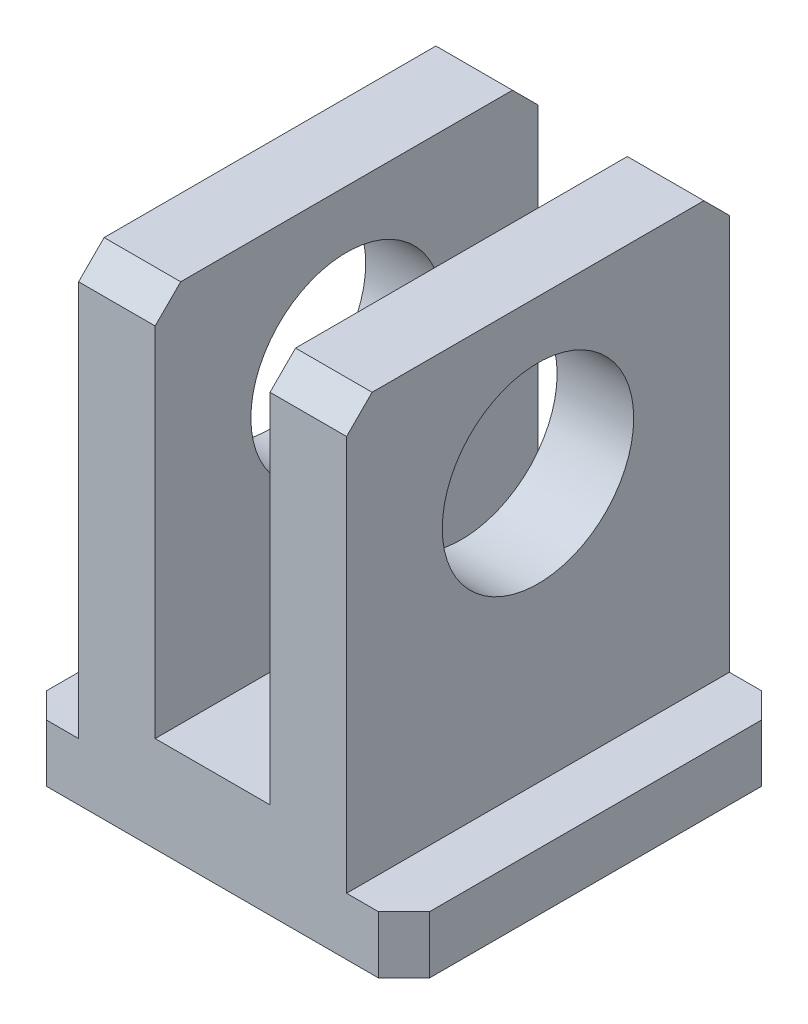
ISO-10303-21;
HEADER;
FILE_DESCRIPTION(('STEP AP214'),'2;1');
FILE_NAME('part.step','',(''),(''),'','','');
FILE_SCHEMA(('AUTOMOTIVE_DESIGN { 1 0 10303 214 1 1 1 1 }'));
ENDSEC;
DATA;
#1=APPLICATION_CONTEXT('core data for automotive mechanical design processes');
#2=APPLICATION_PROTOCOL_DEFINITION('international standard','automotive_design',2000,#1);
#3=PRODUCT_CONTEXT('',#1,'mechanical');
#4=PRODUCT('Part','Part','',(#3));
#5=PRODUCT_RELATED_PRODUCT_CATEGORY('part','',(#4));
#6=PRODUCT_DEFINITION_FORMATION('','',#4);
#7=PRODUCT_DEFINITION_CONTEXT('part definition',#1,'design');
#8=PRODUCT_DEFINITION('design','',#6,#7);
#9=PRODUCT_DEFINITION_SHAPE('','',#8);
#10=(LENGTH_UNIT() NAMED_UNIT(*) SI_UNIT(.MILLI.,.METRE.));
#11=(NAMED_UNIT(*) PLANE_ANGLE_UNIT() SI_UNIT($,.RADIAN.));
#12=(NAMED_UNIT(*) SI_UNIT($,.STERADIAN.) SOLID_ANGLE_UNIT());
#13=UNCERTAINTY_MEASURE_WITH_UNIT(LENGTH_MEASURE(1.E-05),#10,'distance_accuracy_value','');
#14=(GEOMETRIC_REPRESENTATION_CONTEXT(3) GLOBAL_UNCERTAINTY_ASSIGNED_CONTEXT((#13)) GLOBAL_UNIT_ASSIGNED_CONTEXT((#10,
#11,#12)) REPRESENTATION_CONTEXT('',''));
#15=CARTESIAN_POINT('',(0.,0.,0.));
#16=DIRECTION('',(0.,0.,1.));
#17=DIRECTION('',(1.,0.,0.));
#18=AXIS2_PLACEMENT_3D('',#15,#16,#17);
#19=CARTESIAN_POINT('',(15.,37.5,-30.));
#20=DIRECTION('',(0.,-1.,0.));
#21=DIRECTION('',(0.,0.,-1.));
#22=AXIS2_PLACEMENT_3D('',#19,#20,#21);
#23=PLANE('',#22);
#24=DIRECTION('',(-1.,0.,0.));
#25=VECTOR('',#24,1.);
#26=CARTESIAN_POINT('',(15.,37.5,-28.));
#27=LINE('',#26,#25);
#28=CARTESIAN_POINT('',(-4.5,37.5,-28.));
#29=VERTEX_POINT('',#28);
#30=CARTESIAN_POINT('',(-10.5,37.5,-28.));
#31=VERTEX_POINT('',#30);
#32=EDGE_CURVE('E207',#29,#31,#27,.T.);
#33=ORIENTED_EDGE('',*,*,#32,.T.);
#34=DIRECTION('',(0.,0.,1.));
#35=VECTOR('',#34,1.);
#36=CARTESIAN_POINT('',(-10.5,37.5,-30.001));
#37=LINE('',#36,#35);
#38=CARTESIAN_POINT('',(-10.5,37.5,-2.00000000000002));
#39=VERTEX_POINT('',#38);
#40=EDGE_CURVE('E176',#31,#39,#37,.T.);
#41=ORIENTED_EDGE('',*,*,#40,.T.);
#42=DIRECTION('',(1.,0.,0.));
#43=VECTOR('',#42,1.);
#44=CARTESIAN_POINT('',(15.,37.5,-2.00000000000002));
#45=LINE('',#44,#43);
#46=CARTESIAN_POINT('',(-4.5,37.5,-2.00000000000002));
#47=VERTEX_POINT('',#46);
#48=EDGE_CURVE('E310',#39,#47,#45,.T.);
#49=ORIENTED_EDGE('',*,*,#48,.T.);
#50=DIRECTION('',(0.,0.,1.));
#51=VECTOR('',#50,1.);
#52=CARTESIAN_POINT('',(-4.5,37.5,-30.001));
#53=LINE('',#52,#51);
#54=EDGE_CURVE('E285',#29,#47,#53,.T.);
#55=ORIENTED_EDGE('',*,*,#54,.F.);
#56=EDGE_LOOP('',(#33,#41,#49,#55));
#57=FACE_BOUND('',#56,.T.);
#58=ADVANCED_FACE('F33',(#57),#23,.F.);
#59=CARTESIAN_POINT('',(15.,37.5,-28.));
#60=DIRECTION('',(0.,-0.707106781186546,0.707106781186549));
#61=DIRECTION('',(-1.,0.,0.));
#62=AXIS2_PLACEMENT_3D('',#59,#60,#61);
#63=PLANE('',#62);
#64=DIRECTION('',(0.,-0.707106781186549,-0.707106781186546));
#65=VECTOR('',#64,1.);
#66=CARTESIAN_POINT('',(-10.5,36.4995,-29.0005));
#67=LINE('',#66,#65);
#68=CARTESIAN_POINT('',(-10.5,35.5,-30.));
#69=VERTEX_POINT('',#68);
#70=EDGE_CURVE('E169',#69,#31,#67,.F.);
#71=ORIENTED_EDGE('',*,*,#70,.T.);
#72=ORIENTED_EDGE('',*,*,#32,.F.);
#73=DIRECTION('',(0.,0.707106781186549,0.707106781186546));
#74=VECTOR('',#73,1.);
#75=CARTESIAN_POINT('',(-4.5,36.4995,-29.0005));
#76=LINE('',#75,#74);
#77=CARTESIAN_POINT('',(-4.5,35.5,-30.));
#78=VERTEX_POINT('',#77);
#79=EDGE_CURVE('E197',#29,#78,#76,.F.);
#80=ORIENTED_EDGE('',*,*,#79,.T.);
#81=DIRECTION('',(1.,0.,0.));
#82=VECTOR('',#81,1.);
#83=CARTESIAN_POINT('',(15.,35.5,-30.));
#84=LINE('',#83,#82);
#85=EDGE_CURVE('E190',#69,#78,#84,.T.);
#86=ORIENTED_EDGE('',*,*,#85,.F.);
#87=EDGE_LOOP('',(#71,#72,#80,#86));
#88=FACE_BOUND('',#87,.T.);
#89=ADVANCED_FACE('F196',(#88),#63,.F.);
#90=CARTESIAN_POINT('',(15.,35.5,0.));
#91=DIRECTION('',(0.,-0.707106781186549,-0.707106781186546));
#92=DIRECTION('',(-1.,0.,0.));
#93=AXIS2_PLACEMENT_3D('',#90,#91,#92);
#94=PLANE('',#93);
#95=DIRECTION('',(0.,0.707106781186546,-0.707106781186549));
#96=VECTOR('',#95,1.);
#97=CARTESIAN_POINT('',(-10.5,51.5005,-16.0005000000001));
#98=LINE('',#97,#96);
#99=CARTESIAN_POINT('',(-10.5,35.5,0.));
#100=VERTEX_POINT('',#99);
#101=EDGE_CURVE('E182',#39,#100,#98,.F.);
#102=ORIENTED_EDGE('',*,*,#101,.T.);
#103=DIRECTION('',(-1.,0.,0.));
#104=VECTOR('',#103,1.);
#105=CARTESIAN_POINT('',(15.,35.5,0.));
#106=LINE('',#105,#104);
#107=CARTESIAN_POINT('',(-4.5,35.5,0.));
#108=VERTEX_POINT('',#107);
#109=EDGE_CURVE('E198',#108,#100,#106,.T.);
#110=ORIENTED_EDGE('',*,*,#109,.F.);
#111=DIRECTION('',(0.,-0.707106781186546,0.707106781186549));
#112=VECTOR('',#111,1.);
#113=CARTESIAN_POINT('',(-4.5,51.5005,-16.0005000000001));
#114=LINE('',#113,#112);
#115=EDGE_CURVE('E266',#108,#47,#114,.F.);
#116=ORIENTED_EDGE('',*,*,#115,.T.);
#117=ORIENTED_EDGE('',*,*,#48,.F.);
#118=EDGE_LOOP('',(#102,#110,#116,#117));
#119=FACE_BOUND('',#118,.T.);
#120=ADVANCED_FACE('F392',(#119),#94,.F.);
#121=CARTESIAN_POINT('',(15.,37.5,0.));
#122=DIRECTION('',(0.,0.,-1.));
#123=DIRECTION('',(-1.,0.,0.));
#124=AXIS2_PLACEMENT_3D('',#121,#122,#123);
#125=PLANE('',#124);
#126=DIRECTION('',(1.,0.,0.));
#127=VECTOR('',#126,1.);
#128=CARTESIAN_POINT('',(-15.,4.5,0.));
#129=LINE('',#128,#127);
#130=CARTESIAN_POINT('',(-13.,4.5,0.));
#131=VERTEX_POINT('',#130);
#132=CARTESIAN_POINT('',(-10.5,4.5,0.));
#133=VERTEX_POINT('',#132);
#134=EDGE_CURVE('E193',#131,#133,#129,.T.);
#135=ORIENTED_EDGE('',*,*,#134,.F.);
#136=DIRECTION('',(0.,-1.,0.));
#137=VECTOR('',#136,1.);
#138=CARTESIAN_POINT('',(-13.,37.5,0.));
#139=LINE('',#138,#137);
#140=CARTESIAN_POINT('',(-13.,0.,0.));
#141=VERTEX_POINT('',#140);
#142=EDGE_CURVE('E232',#131,#141,#139,.T.);
#143=ORIENTED_EDGE('',*,*,#142,.T.);
#144=DIRECTION('',(-1.,0.,0.));
#145=VECTOR('',#144,1.);
#146=CARTESIAN_POINT('',(15.,0.,0.));
#147=LINE('',#146,#145);
#148=CARTESIAN_POINT('',(13.,0.,0.));
#149=VERTEX_POINT('',#148);
#150=EDGE_CURVE('E306',#149,#141,#147,.T.);
#151=ORIENTED_EDGE('',*,*,#150,.F.);
#152=DIRECTION('',(0.,1.,0.));
#153=VECTOR('',#152,1.);
#154=CARTESIAN_POINT('',(13.,4.5,0.));
#155=LINE('',#154,#153);
#156=CARTESIAN_POINT('',(13.,4.5,0.));
#157=VERTEX_POINT('',#156);
#158=EDGE_CURVE('E230',#149,#157,#155,.T.);
#159=ORIENTED_EDGE('',*,*,#158,.T.);
#160=DIRECTION('',(1.,0.,0.));
#161=VECTOR('',#160,1.);
#162=CARTESIAN_POINT('',(10.5,4.5,0.));
#163=LINE('',#162,#161);
#164=CARTESIAN_POINT('',(10.5,4.5,0.));
#165=VERTEX_POINT('',#164);
#166=EDGE_CURVE('E258',#165,#157,#163,.T.);
#167=ORIENTED_EDGE('',*,*,#166,.F.);
#168=DIRECTION('',(0.,-1.,0.));
#169=VECTOR('',#168,1.);
#170=CARTESIAN_POINT('',(10.5,37.5,0.));
#171=LINE('',#170,#169);
#172=CARTESIAN_POINT('',(10.5,35.5,0.));
#173=VERTEX_POINT('',#172);
#174=EDGE_CURVE('E344',#173,#165,#171,.T.);
#175=ORIENTED_EDGE('',*,*,#174,.F.);
#176=CARTESIAN_POINT('',(4.5,35.5,0.));
#177=VERTEX_POINT('',#176);
#178=EDGE_CURVE('E202',#173,#177,#106,.T.);
#179=ORIENTED_EDGE('',*,*,#178,.T.);
#180=DIRECTION('',(0.,1.,0.));
#181=VECTOR('',#180,1.);
#182=CARTESIAN_POINT('',(4.5,37.5,0.));
#183=LINE('',#182,#181);
#184=CARTESIAN_POINT('',(4.5,7.5,0.));
#185=VERTEX_POINT('',#184);
#186=EDGE_CURVE('E282',#185,#177,#183,.T.);
#187=ORIENTED_EDGE('',*,*,#186,.F.);
#188=DIRECTION('',(1.,0.,0.));
#189=VECTOR('',#188,1.);
#190=CARTESIAN_POINT('',(-4.5,7.5,0.));
#191=LINE('',#190,#189);
#192=CARTESIAN_POINT('',(-4.5,7.5,0.));
#193=VERTEX_POINT('',#192);
#194=EDGE_CURVE('E279',#193,#185,#191,.T.);
#195=ORIENTED_EDGE('',*,*,#194,.F.);
#196=DIRECTION('',(0.,-1.,0.));
#197=VECTOR('',#196,1.);
#198=CARTESIAN_POINT('',(-4.5,37.5,0.));
#199=LINE('',#198,#197);
#200=EDGE_CURVE('E276',#108,#193,#199,.T.);
#201=ORIENTED_EDGE('',*,*,#200,.F.);
#202=ORIENTED_EDGE('',*,*,#109,.T.);
#203=DIRECTION('',(0.,1.,0.));
#204=VECTOR('',#203,1.);
#205=CARTESIAN_POINT('',(-10.5,37.5,0.));
#206=LINE('',#205,#204);
#207=EDGE_CURVE('E355',#133,#100,#206,.T.);
#208=ORIENTED_EDGE('',*,*,#207,.F.);
#209=EDGE_LOOP('',(#135,#143,#151,#159,#167,#175,#179,#187,#195,#201,#202,#208));
#210=FACE_BOUND('',#209,.T.);
#211=ADVANCED_FACE('F341',(#210),#125,.F.);
#212=CARTESIAN_POINT('',(15.,0.,0.));
#213=DIRECTION('',(0.,1.,0.));
#214=DIRECTION('',(0.,0.,1.));
#215=AXIS2_PLACEMENT_3D('',#212,#213,#214);
#216=PLANE('',#215);
#217=DIRECTION('',(0.,0.,-1.));
#218=VECTOR('',#217,1.);
#219=CARTESIAN_POINT('',(-15.,0.,0.));
#220=LINE('',#219,#218);
#221=CARTESIAN_POINT('',(-15.,0.,-2.00000000000001));
#222=VERTEX_POINT('',#221);
#223=CARTESIAN_POINT('',(-15.,0.,-28.));
#224=VERTEX_POINT('',#223);
#225=EDGE_CURVE('E302',#222,#224,#220,.T.);
#226=ORIENTED_EDGE('',*,*,#225,.T.);
#227=DIRECTION('',(-0.707106781186546,0.,0.707106781186549));
#228=VECTOR('',#227,1.);
#229=CARTESIAN_POINT('',(-13.,0.,-30.));
#230=LINE('',#229,#228);
#231=CARTESIAN_POINT('',(-13.,0.,-30.));
#232=VERTEX_POINT('',#231);
#233=EDGE_CURVE('E228',#224,#232,#230,.F.);
#234=ORIENTED_EDGE('',*,*,#233,.T.);
#235=DIRECTION('',(-1.,0.,0.));
#236=VECTOR('',#235,1.);
#237=CARTESIAN_POINT('',(15.,0.,-30.));
#238=LINE('',#237,#236);
#239=CARTESIAN_POINT('',(13.,0.,-30.));
#240=VERTEX_POINT('',#239);
#241=EDGE_CURVE('E301',#240,#232,#238,.T.);
#242=ORIENTED_EDGE('',*,*,#241,.F.);
#243=DIRECTION('',(0.707106781186549,0.,0.707106781186546));
#244=VECTOR('',#243,1.);
#245=CARTESIAN_POINT('',(15.,0.,-28.));
#246=LINE('',#245,#244);
#247=CARTESIAN_POINT('',(15.,0.,-28.));
#248=VERTEX_POINT('',#247);
#249=EDGE_CURVE('E224',#240,#248,#246,.T.);
#250=ORIENTED_EDGE('',*,*,#249,.T.);
#251=DIRECTION('',(0.,0.,-1.));
#252=VECTOR('',#251,1.);
#253=CARTESIAN_POINT('',(15.,0.,0.));
#254=LINE('',#253,#252);
#255=CARTESIAN_POINT('',(15.,0.,-2.));
#256=VERTEX_POINT('',#255);
#257=EDGE_CURVE('E245',#256,#248,#254,.T.);
#258=ORIENTED_EDGE('',*,*,#257,.F.);
#259=DIRECTION('',(-0.707106781186549,0.,0.707106781186546));
#260=VECTOR('',#259,1.);
#261=CARTESIAN_POINT('',(15.,0.,-2.));
#262=LINE('',#261,#260);
#263=EDGE_CURVE('E222',#256,#149,#262,.T.);
#264=ORIENTED_EDGE('',*,*,#263,.T.);
#265=ORIENTED_EDGE('',*,*,#150,.T.);
#266=DIRECTION('',(0.707106781186546,0.,0.707106781186549));
#267=VECTOR('',#266,1.);
#268=CARTESIAN_POINT('',(-13.,0.,0.));
#269=LINE('',#268,#267);
#270=EDGE_CURVE('E226',#141,#222,#269,.F.);
#271=ORIENTED_EDGE('',*,*,#270,.T.);
#272=EDGE_LOOP('',(#226,#234,#242,#250,#258,#264,#265,#271));
#273=FACE_BOUND('',#272,.T.);
#274=ADVANCED_FACE('F408',(#273),#216,.F.);
#275=CARTESIAN_POINT('',(15.,0.,-30.));
#276=DIRECTION('',(0.,0.,1.));
#277=DIRECTION('',(1.,0.,0.));
#278=AXIS2_PLACEMENT_3D('',#275,#276,#277);
#279=PLANE('',#278);
#280=ORIENTED_EDGE('',*,*,#241,.T.);
#281=DIRECTION('',(0.,1.,0.));
#282=VECTOR('',#281,1.);
#283=CARTESIAN_POINT('',(-13.,0.,-30.));
#284=LINE('',#283,#282);
#285=CARTESIAN_POINT('',(-13.,4.5,-30.));
#286=VERTEX_POINT('',#285);
#287=EDGE_CURVE('E212',#232,#286,#284,.T.);
#288=ORIENTED_EDGE('',*,*,#287,.T.);
#289=DIRECTION('',(-1.,0.,0.));
#290=VECTOR('',#289,1.);
#291=CARTESIAN_POINT('',(-15.,4.5,-30.));
#292=LINE('',#291,#290);
#293=CARTESIAN_POINT('',(-10.5,4.5,-30.));
#294=VERTEX_POINT('',#293);
#295=EDGE_CURVE('E181',#294,#286,#292,.T.);
#296=ORIENTED_EDGE('',*,*,#295,.F.);
#297=DIRECTION('',(0.,-1.,0.));
#298=VECTOR('',#297,1.);
#299=CARTESIAN_POINT('',(-10.5,37.5,-30.));
#300=LINE('',#299,#298);
#301=EDGE_CURVE('E173',#69,#294,#300,.T.);
#302=ORIENTED_EDGE('',*,*,#301,.F.);
#303=ORIENTED_EDGE('',*,*,#85,.T.);
#304=DIRECTION('',(0.,1.,0.));
#305=VECTOR('',#304,1.);
#306=CARTESIAN_POINT('',(-4.5,37.5,-30.));
#307=LINE('',#306,#305);
#308=CARTESIAN_POINT('',(-4.5,7.5,-30.));
#309=VERTEX_POINT('',#308);
#310=EDGE_CURVE('E273',#309,#78,#307,.T.);
#311=ORIENTED_EDGE('',*,*,#310,.F.);
#312=DIRECTION('',(-1.,0.,0.));
#313=VECTOR('',#312,1.);
#314=CARTESIAN_POINT('',(-4.5,7.5,-30.));
#315=LINE('',#314,#313);
#316=CARTESIAN_POINT('',(4.5,7.5,-30.));
#317=VERTEX_POINT('',#316);
#318=EDGE_CURVE('E287',#317,#309,#315,.T.);
#319=ORIENTED_EDGE('',*,*,#318,.F.);
#320=DIRECTION('',(0.,-1.,0.));
#321=VECTOR('',#320,1.);
#322=CARTESIAN_POINT('',(4.5,37.5,-30.));
#323=LINE('',#322,#321);
#324=CARTESIAN_POINT('',(4.5,35.5,-30.));
#325=VERTEX_POINT('',#324);
#326=EDGE_CURVE('E270',#325,#317,#323,.T.);
#327=ORIENTED_EDGE('',*,*,#326,.F.);
#328=CARTESIAN_POINT('',(10.5,35.5,-30.));
#329=VERTEX_POINT('',#328);
#330=EDGE_CURVE('E199',#325,#329,#84,.T.);
#331=ORIENTED_EDGE('',*,*,#330,.T.);
#332=DIRECTION('',(0.,1.,0.));
#333=VECTOR('',#332,1.);
#334=CARTESIAN_POINT('',(10.5,37.5,-30.));
#335=LINE('',#334,#333);
#336=CARTESIAN_POINT('',(10.5,4.5,-30.));
#337=VERTEX_POINT('',#336);
#338=EDGE_CURVE('E253',#337,#329,#335,.T.);
#339=ORIENTED_EDGE('',*,*,#338,.F.);
#340=DIRECTION('',(-1.,0.,0.));
#341=VECTOR('',#340,1.);
#342=CARTESIAN_POINT('',(10.5,4.5,-30.));
#343=LINE('',#342,#341);
#344=CARTESIAN_POINT('',(13.,4.5,-30.));
#345=VERTEX_POINT('',#344);
#346=EDGE_CURVE('E347',#345,#337,#343,.T.);
#347=ORIENTED_EDGE('',*,*,#346,.F.);
#348=DIRECTION('',(0.,-1.,0.));
#349=VECTOR('',#348,1.);
#350=CARTESIAN_POINT('',(13.,0.,-30.));
#351=LINE('',#350,#349);
#352=EDGE_CURVE('E210',#345,#240,#351,.T.);
#353=ORIENTED_EDGE('',*,*,#352,.T.);
#354=EDGE_LOOP('',(#280,#288,#296,#302,#303,#311,#319,#327,#331,#339,#347,#353));
#355=FACE_BOUND('',#354,.T.);
#356=ADVANCED_FACE('F188',(#355),#279,.F.);
#357=CARTESIAN_POINT('',(4.5,37.5,-2.00000000000002));
#358=VERTEX_POINT('',#357);
#359=CARTESIAN_POINT('',(10.5,37.5,-2.00000000000002));
#360=VERTEX_POINT('',#359);
#361=EDGE_CURVE('E308',#358,#360,#45,.T.);
#362=ORIENTED_EDGE('',*,*,#361,.T.);
#363=DIRECTION('',(0.,0.,1.));
#364=VECTOR('',#363,1.);
#365=CARTESIAN_POINT('',(10.5,37.5,-30.001));
#366=LINE('',#365,#364);
#367=CARTESIAN_POINT('',(10.5,37.5,-28.));
#368=VERTEX_POINT('',#367);
#369=EDGE_CURVE('E255',#368,#360,#366,.T.);
#370=ORIENTED_EDGE('',*,*,#369,.F.);
#371=CARTESIAN_POINT('',(4.5,37.5,-28.));
#372=VERTEX_POINT('',#371);
#373=EDGE_CURVE('E205',#368,#372,#27,.T.);
#374=ORIENTED_EDGE('',*,*,#373,.T.);
#375=DIRECTION('',(0.,0.,1.));
#376=VECTOR('',#375,1.);
#377=CARTESIAN_POINT('',(4.5,37.5,-30.001));
#378=LINE('',#377,#376);
#379=EDGE_CURVE('E288',#372,#358,#378,.T.);
#380=ORIENTED_EDGE('',*,*,#379,.T.);
#381=EDGE_LOOP('',(#362,#370,#374,#380));
#382=FACE_BOUND('',#381,.T.);
#383=ADVANCED_FACE('F320',(#382),#23,.F.);
#384=CARTESIAN_POINT('',(15.,0.,0.));
#385=DIRECTION('',(1.,0.,0.));
#386=DIRECTION('',(0.,0.,-1.));
#387=AXIS2_PLACEMENT_3D('',#384,#385,#386);
#388=PLANE('',#387);
#389=ORIENTED_EDGE('',*,*,#257,.T.);
#390=DIRECTION('',(0.,1.,0.));
#391=VECTOR('',#390,1.);
#392=CARTESIAN_POINT('',(15.,4.5,-28.));
#393=LINE('',#392,#391);
#394=CARTESIAN_POINT('',(15.,4.5,-28.));
#395=VERTEX_POINT('',#394);
#396=EDGE_CURVE('E238',#248,#395,#393,.T.);
#397=ORIENTED_EDGE('',*,*,#396,.T.);
#398=DIRECTION('',(0.,0.,1.));
#399=VECTOR('',#398,1.);
#400=CARTESIAN_POINT('',(15.,4.5,-30.001));
#401=LINE('',#400,#399);
#402=CARTESIAN_POINT('',(15.,4.5,-2.));
#403=VERTEX_POINT('',#402);
#404=EDGE_CURVE('E242',#395,#403,#401,.T.);
#405=ORIENTED_EDGE('',*,*,#404,.T.);
#406=DIRECTION('',(0.,-1.,0.));
#407=VECTOR('',#406,1.);
#408=CARTESIAN_POINT('',(15.,0.,-2.));
#409=LINE('',#408,#407);
#410=EDGE_CURVE('E235',#403,#256,#409,.T.);
#411=ORIENTED_EDGE('',*,*,#410,.T.);
#412=EDGE_LOOP('',(#389,#397,#405,#411));
#413=FACE_BOUND('',#412,.T.);
#414=ADVANCED_FACE('F241',(#413),#388,.T.);
#415=CARTESIAN_POINT('',(-15.,0.,0.));
#416=DIRECTION('',(1.,0.,0.));
#417=DIRECTION('',(0.,0.,-1.));
#418=AXIS2_PLACEMENT_3D('',#415,#416,#417);
#419=PLANE('',#418);
#420=DIRECTION('',(0.,0.,1.));
#421=VECTOR('',#420,1.);
#422=CARTESIAN_POINT('',(-15.,4.5,-30.001));
#423=LINE('',#422,#421);
#424=CARTESIAN_POINT('',(-15.,4.5,-28.));
#425=VERTEX_POINT('',#424);
#426=CARTESIAN_POINT('',(-15.,4.5,-2.00000000000001));
#427=VERTEX_POINT('',#426);
#428=EDGE_CURVE('E351',#425,#427,#423,.T.);
#429=ORIENTED_EDGE('',*,*,#428,.F.);
#430=DIRECTION('',(0.,-1.,0.));
#431=VECTOR('',#430,1.);
#432=CARTESIAN_POINT('',(-15.,0.,-28.));
#433=LINE('',#432,#431);
#434=EDGE_CURVE('E220',#425,#224,#433,.T.);
#435=ORIENTED_EDGE('',*,*,#434,.T.);
#436=ORIENTED_EDGE('',*,*,#225,.F.);
#437=DIRECTION('',(0.,1.,0.));
#438=VECTOR('',#437,1.);
#439=CARTESIAN_POINT('',(-15.,0.,-2.00000000000001));
#440=LINE('',#439,#438);
#441=EDGE_CURVE('E218',#222,#427,#440,.T.);
#442=ORIENTED_EDGE('',*,*,#441,.T.);
#443=EDGE_LOOP('',(#429,#435,#436,#442));
#444=FACE_BOUND('',#443,.T.);
#445=ADVANCED_FACE('F406',(#444),#419,.F.);
#446=DIRECTION('',(0.,0.707106781186549,0.707106781186546));
#447=VECTOR('',#446,1.);
#448=CARTESIAN_POINT('',(10.5,36.4995,-29.0005));
#449=LINE('',#448,#447);
#450=EDGE_CURVE('E249',#368,#329,#449,.F.);
#451=ORIENTED_EDGE('',*,*,#450,.T.);
#452=ORIENTED_EDGE('',*,*,#330,.F.);
#453=DIRECTION('',(0.,-0.707106781186549,-0.707106781186546));
#454=VECTOR('',#453,1.);
#455=CARTESIAN_POINT('',(4.5,36.4995,-29.0005));
#456=LINE('',#455,#454);
#457=EDGE_CURVE('E296',#325,#372,#456,.F.);
#458=ORIENTED_EDGE('',*,*,#457,.T.);
#459=ORIENTED_EDGE('',*,*,#373,.F.);
#460=EDGE_LOOP('',(#451,#452,#458,#459));
#461=FACE_BOUND('',#460,.T.);
#462=ADVANCED_FACE('F322',(#461),#63,.F.);
#463=DIRECTION('',(0.,-0.707106781186546,0.707106781186549));
#464=VECTOR('',#463,1.);
#465=CARTESIAN_POINT('',(10.5,51.5005,-16.0005000000001));
#466=LINE('',#465,#464);
#467=EDGE_CURVE('E299',#173,#360,#466,.F.);
#468=ORIENTED_EDGE('',*,*,#467,.T.);
#469=ORIENTED_EDGE('',*,*,#361,.F.);
#470=DIRECTION('',(0.,0.707106781186546,-0.707106781186549));
#471=VECTOR('',#470,1.);
#472=CARTESIAN_POINT('',(4.5,51.5005,-16.0005000000001));
#473=LINE('',#472,#471);
#474=EDGE_CURVE('E263',#358,#177,#473,.F.);
#475=ORIENTED_EDGE('',*,*,#474,.T.);
#476=ORIENTED_EDGE('',*,*,#178,.F.);
#477=EDGE_LOOP('',(#468,#469,#475,#476));
#478=FACE_BOUND('',#477,.T.);
#479=ADVANCED_FACE('F338',(#478),#94,.F.);
#480=CARTESIAN_POINT('',(-4.5,37.5,-30.001));
#481=DIRECTION('',(-1.,0.,0.));
#482=DIRECTION('',(0.,0.,1.));
#483=AXIS2_PLACEMENT_3D('',#480,#481,#482);
#484=PLANE('',#483);
#485=CARTESIAN_POINT('',(-4.5,25.5,-15.));
#486=DIRECTION('',(-1.,0.,0.));
#487=DIRECTION('',(0.,0.,1.));
#488=AXIS2_PLACEMENT_3D('',#485,#486,#487);
#489=CIRCLE('',#488,7.5);
#490=CARTESIAN_POINT('',(-4.5,25.5,-7.5));
#491=VERTEX_POINT('',#490);
#492=EDGE_CURVE('E267',#491,#491,#489,.T.);
#493=ORIENTED_EDGE('',*,*,#492,.T.);
#494=EDGE_LOOP('',(#493));
#495=FACE_BOUND('',#494,.T.);
#496=ORIENTED_EDGE('',*,*,#310,.T.);
#497=ORIENTED_EDGE('',*,*,#79,.F.);
#498=ORIENTED_EDGE('',*,*,#54,.T.);
#499=ORIENTED_EDGE('',*,*,#115,.F.);
#500=ORIENTED_EDGE('',*,*,#200,.T.);
#501=DIRECTION('',(0.,0.,1.));
#502=VECTOR('',#501,1.);
#503=CARTESIAN_POINT('',(-4.5,7.5,-30.001));
#504=LINE('',#503,#502);
#505=EDGE_CURVE('E284',#309,#193,#504,.T.);
#506=ORIENTED_EDGE('',*,*,#505,.F.);
#507=EDGE_LOOP('',(#496,#497,#498,#499,#500,#506));
#508=FACE_BOUND('',#507,.T.);
#509=ADVANCED_FACE('F384',(#495,#508),#484,.F.);
#510=CARTESIAN_POINT('',(4.5,37.5,-30.001));
#511=DIRECTION('',(1.,0.,0.));
#512=DIRECTION('',(0.,0.,-1.));
#513=AXIS2_PLACEMENT_3D('',#510,#511,#512);
#514=PLANE('',#513);
#515=CARTESIAN_POINT('',(4.5,25.5,-15.));
#516=DIRECTION('',(1.,0.,0.));
#517=DIRECTION('',(0.,0.,-1.));
#518=AXIS2_PLACEMENT_3D('',#515,#516,#517);
#519=CIRCLE('',#518,7.5);
#520=CARTESIAN_POINT('',(4.5,25.5,-22.5));
#521=VERTEX_POINT('',#520);
#522=EDGE_CURVE('E365',#521,#521,#519,.T.);
#523=ORIENTED_EDGE('',*,*,#522,.T.);
#524=EDGE_LOOP('',(#523));
#525=FACE_BOUND('',#524,.T.);
#526=ORIENTED_EDGE('',*,*,#326,.T.);
#527=DIRECTION('',(0.,0.,1.));
#528=VECTOR('',#527,1.);
#529=CARTESIAN_POINT('',(4.5,7.5,-30.001));
#530=LINE('',#529,#528);
#531=EDGE_CURVE('E291',#317,#185,#530,.T.);
#532=ORIENTED_EDGE('',*,*,#531,.T.);
#533=ORIENTED_EDGE('',*,*,#186,.T.);
#534=ORIENTED_EDGE('',*,*,#474,.F.);
#535=ORIENTED_EDGE('',*,*,#379,.F.);
#536=ORIENTED_EDGE('',*,*,#457,.F.);
#537=EDGE_LOOP('',(#526,#532,#533,#534,#535,#536));
#538=FACE_BOUND('',#537,.T.);
#539=ADVANCED_FACE('F326',(#525,#538),#514,.F.);
#540=CARTESIAN_POINT('',(-4.5,7.5,-30.001));
#541=DIRECTION('',(0.,-1.,0.));
#542=DIRECTION('',(0.,0.,-1.));
#543=AXIS2_PLACEMENT_3D('',#540,#541,#542);
#544=PLANE('',#543);
#545=ORIENTED_EDGE('',*,*,#318,.T.);
#546=ORIENTED_EDGE('',*,*,#505,.T.);
#547=ORIENTED_EDGE('',*,*,#194,.T.);
#548=ORIENTED_EDGE('',*,*,#531,.F.);
#549=EDGE_LOOP('',(#545,#546,#547,#548));
#550=FACE_BOUND('',#549,.T.);
#551=ADVANCED_FACE('F330',(#550),#544,.F.);
#552=CARTESIAN_POINT('',(10.5,4.5,-30.001));
#553=DIRECTION('',(0.,-1.,0.));
#554=DIRECTION('',(0.,0.,-1.));
#555=AXIS2_PLACEMENT_3D('',#552,#553,#554);
#556=PLANE('',#555);
#557=ORIENTED_EDGE('',*,*,#404,.F.);
#558=DIRECTION('',(-0.707106781186549,0.,-0.707106781186546));
#559=VECTOR('',#558,1.);
#560=CARTESIAN_POINT('',(15.,4.5,-28.));
#561=LINE('',#560,#559);
#562=EDGE_CURVE('E11',#395,#345,#561,.T.);
#563=ORIENTED_EDGE('',*,*,#562,.T.);
#564=ORIENTED_EDGE('',*,*,#346,.T.);
#565=DIRECTION('',(0.,0.,1.));
#566=VECTOR('',#565,1.);
#567=CARTESIAN_POINT('',(10.5,4.5,-30.001));
#568=LINE('',#567,#566);
#569=EDGE_CURVE('E250',#337,#165,#568,.T.);
#570=ORIENTED_EDGE('',*,*,#569,.T.);
#571=ORIENTED_EDGE('',*,*,#166,.T.);
#572=DIRECTION('',(0.707106781186549,0.,-0.707106781186546));
#573=VECTOR('',#572,1.);
#574=CARTESIAN_POINT('',(15.,4.5,-2.));
#575=LINE('',#574,#573);
#576=EDGE_CURVE('E41',#157,#403,#575,.T.);
#577=ORIENTED_EDGE('',*,*,#576,.T.);
#578=EDGE_LOOP('',(#557,#563,#564,#570,#571,#577));
#579=FACE_BOUND('',#578,.T.);
#580=ADVANCED_FACE('F247',(#579),#556,.F.);
#581=CARTESIAN_POINT('',(10.5,37.5,-30.001));
#582=DIRECTION('',(-1.,0.,0.));
#583=DIRECTION('',(0.,0.,1.));
#584=AXIS2_PLACEMENT_3D('',#581,#582,#583);
#585=PLANE('',#584);
#586=CARTESIAN_POINT('',(10.5,25.5,-15.));
#587=DIRECTION('',(1.,0.,0.));
#588=DIRECTION('',(0.,0.,-1.));
#589=AXIS2_PLACEMENT_3D('',#586,#587,#588);
#590=CIRCLE('',#589,7.5);
#591=CARTESIAN_POINT('',(10.5,25.5,-22.5));
#592=VERTEX_POINT('',#591);
#593=EDGE_CURVE('E369',#592,#592,#590,.T.);
#594=ORIENTED_EDGE('',*,*,#593,.F.);
#595=EDGE_LOOP('',(#594));
#596=FACE_BOUND('',#595,.T.);
#597=ORIENTED_EDGE('',*,*,#338,.T.);
#598=ORIENTED_EDGE('',*,*,#450,.F.);
#599=ORIENTED_EDGE('',*,*,#369,.T.);
#600=ORIENTED_EDGE('',*,*,#467,.F.);
#601=ORIENTED_EDGE('',*,*,#174,.T.);
#602=ORIENTED_EDGE('',*,*,#569,.F.);
#603=EDGE_LOOP('',(#597,#598,#599,#600,#601,#602));
#604=FACE_BOUND('',#603,.T.);
#605=ADVANCED_FACE('F446',(#596,#604),#585,.F.);
#606=CARTESIAN_POINT('',(-10.5,37.5,-30.001));
#607=DIRECTION('',(1.,0.,0.));
#608=DIRECTION('',(0.,0.,-1.));
#609=AXIS2_PLACEMENT_3D('',#606,#607,#608);
#610=PLANE('',#609);
#611=CARTESIAN_POINT('',(-10.5,25.5,-15.));
#612=DIRECTION('',(1.,0.,0.));
#613=DIRECTION('',(0.,0.,-1.));
#614=AXIS2_PLACEMENT_3D('',#611,#612,#613);
#615=CIRCLE('',#614,7.5);
#616=CARTESIAN_POINT('',(-10.5,25.5,-22.5));
#617=VERTEX_POINT('',#616);
#618=EDGE_CURVE('E368',#617,#617,#615,.T.);
#619=ORIENTED_EDGE('',*,*,#618,.T.);
#620=EDGE_LOOP('',(#619));
#621=FACE_BOUND('',#620,.T.);
#622=ORIENTED_EDGE('',*,*,#301,.T.);
#623=DIRECTION('',(0.,0.,1.));
#624=VECTOR('',#623,1.);
#625=CARTESIAN_POINT('',(-10.5,4.5,-30.001));
#626=LINE('',#625,#624);
#627=EDGE_CURVE('E354',#294,#133,#626,.T.);
#628=ORIENTED_EDGE('',*,*,#627,.T.);
#629=ORIENTED_EDGE('',*,*,#207,.T.);
#630=ORIENTED_EDGE('',*,*,#101,.F.);
#631=ORIENTED_EDGE('',*,*,#40,.F.);
#632=ORIENTED_EDGE('',*,*,#70,.F.);
#633=EDGE_LOOP('',(#622,#628,#629,#630,#631,#632));
#634=FACE_BOUND('',#633,.T.);
#635=ADVANCED_FACE('F171',(#621,#634),#610,.F.);
#636=CARTESIAN_POINT('',(-15.,4.5,-30.001));
#637=DIRECTION('',(0.,-1.,0.));
#638=DIRECTION('',(0.,0.,-1.));
#639=AXIS2_PLACEMENT_3D('',#636,#637,#638);
#640=PLANE('',#639);
#641=ORIENTED_EDGE('',*,*,#295,.T.);
#642=DIRECTION('',(0.707106781186546,0.,-0.707106781186549));
#643=VECTOR('',#642,1.);
#644=CARTESIAN_POINT('',(-13.,4.5,-30.));
#645=LINE('',#644,#643);
#646=EDGE_CURVE('E216',#286,#425,#645,.F.);
#647=ORIENTED_EDGE('',*,*,#646,.T.);
#648=ORIENTED_EDGE('',*,*,#428,.T.);
#649=DIRECTION('',(-0.707106781186546,0.,-0.707106781186549));
#650=VECTOR('',#649,1.);
#651=CARTESIAN_POINT('',(-13.,4.5,0.));
#652=LINE('',#651,#650);
#653=EDGE_CURVE('E214',#427,#131,#652,.F.);
#654=ORIENTED_EDGE('',*,*,#653,.T.);
#655=ORIENTED_EDGE('',*,*,#134,.T.);
#656=ORIENTED_EDGE('',*,*,#627,.F.);
#657=EDGE_LOOP('',(#641,#647,#648,#654,#655,#656));
#658=FACE_BOUND('',#657,.T.);
#659=ADVANCED_FACE('F380',(#658),#640,.F.);
#660=CARTESIAN_POINT('',(-10.5,25.5,-15.));
#661=DIRECTION('',(1.,0.,0.));
#662=DIRECTION('',(0.,0.,-1.));
#663=AXIS2_PLACEMENT_3D('',#660,#661,#662);
#664=CYLINDRICAL_SURFACE('',#663,7.5);
#665=ORIENTED_EDGE('',*,*,#618,.F.);
#666=EDGE_LOOP('',(#665));
#667=FACE_BOUND('',#666,.T.);
#668=ORIENTED_EDGE('',*,*,#492,.F.);
#669=EDGE_LOOP('',(#668));
#670=FACE_BOUND('',#669,.T.);
#671=ADVANCED_FACE('F376',(#667,#670),#664,.F.);
#672=ORIENTED_EDGE('',*,*,#593,.T.);
#673=EDGE_LOOP('',(#672));
#674=FACE_BOUND('',#673,.T.);
#675=ORIENTED_EDGE('',*,*,#522,.F.);
#676=EDGE_LOOP('',(#675));
#677=FACE_BOUND('',#676,.T.);
#678=ADVANCED_FACE('F379',(#674,#677),#664,.F.);
#679=CARTESIAN_POINT('',(-13.,0.,-30.));
#680=DIRECTION('',(0.707106781186549,0.,0.707106781186546));
#681=DIRECTION('',(0.,1.,0.));
#682=AXIS2_PLACEMENT_3D('',#679,#680,#681);
#683=PLANE('',#682);
#684=ORIENTED_EDGE('',*,*,#233,.F.);
#685=ORIENTED_EDGE('',*,*,#434,.F.);
#686=ORIENTED_EDGE('',*,*,#646,.F.);
#687=ORIENTED_EDGE('',*,*,#287,.F.);
#688=EDGE_LOOP('',(#684,#685,#686,#687));
#689=FACE_BOUND('',#688,.T.);
#690=ADVANCED_FACE('F420',(#689),#683,.F.);
#691=CARTESIAN_POINT('',(-13.,37.5,0.));
#692=DIRECTION('',(0.707106781186549,0.,-0.707106781186546));
#693=DIRECTION('',(0.,-1.,0.));
#694=AXIS2_PLACEMENT_3D('',#691,#692,#693);
#695=PLANE('',#694);
#696=ORIENTED_EDGE('',*,*,#653,.F.);
#697=ORIENTED_EDGE('',*,*,#441,.F.);
#698=ORIENTED_EDGE('',*,*,#270,.F.);
#699=ORIENTED_EDGE('',*,*,#142,.F.);
#700=EDGE_LOOP('',(#696,#697,#698,#699));
#701=FACE_BOUND('',#700,.T.);
#702=ADVANCED_FACE('F423',(#701),#695,.F.);
#703=CARTESIAN_POINT('',(15.,0.,-28.));
#704=DIRECTION('',(0.707106781186546,0.,-0.707106781186549));
#705=DIRECTION('',(0.,-1.,0.));
#706=AXIS2_PLACEMENT_3D('',#703,#704,#705);
#707=PLANE('',#706);
#708=ORIENTED_EDGE('',*,*,#249,.F.);
#709=ORIENTED_EDGE('',*,*,#352,.F.);
#710=ORIENTED_EDGE('',*,*,#562,.F.);
#711=ORIENTED_EDGE('',*,*,#396,.F.);
#712=EDGE_LOOP('',(#708,#709,#710,#711));
#713=FACE_BOUND('',#712,.T.);
#714=ADVANCED_FACE('F426',(#713),#707,.T.);
#715=CARTESIAN_POINT('',(15.,0.,-2.));
#716=DIRECTION('',(0.707106781186546,0.,0.707106781186549));
#717=DIRECTION('',(0.,1.,0.));
#718=AXIS2_PLACEMENT_3D('',#715,#716,#717);
#719=PLANE('',#718);
#720=ORIENTED_EDGE('',*,*,#576,.F.);
#721=ORIENTED_EDGE('',*,*,#158,.F.);
#722=ORIENTED_EDGE('',*,*,#263,.F.);
#723=ORIENTED_EDGE('',*,*,#410,.F.);
#724=EDGE_LOOP('',(#720,#721,#722,#723));
#725=FACE_BOUND('',#724,.T.);
#726=ADVANCED_FACE('F35',(#725),#719,.T.);
#727=CLOSED_SHELL('',(#58,#89,#120,#211,#274,#356,#383,#414,#445,#462,#479,#509,#539,#551,#580,
#605,#635,#659,#671,#678,#690,#702,#714,#726));
#728=MANIFOLD_SOLID_BREP('B2',#727);
#729=ADVANCED_BREP_SHAPE_REPRESENTATION('',(#18,#728),#14);
#730=SHAPE_DEFINITION_REPRESENTATION(#9,#729);
ENDSEC;
END-ISO-10303-21;
